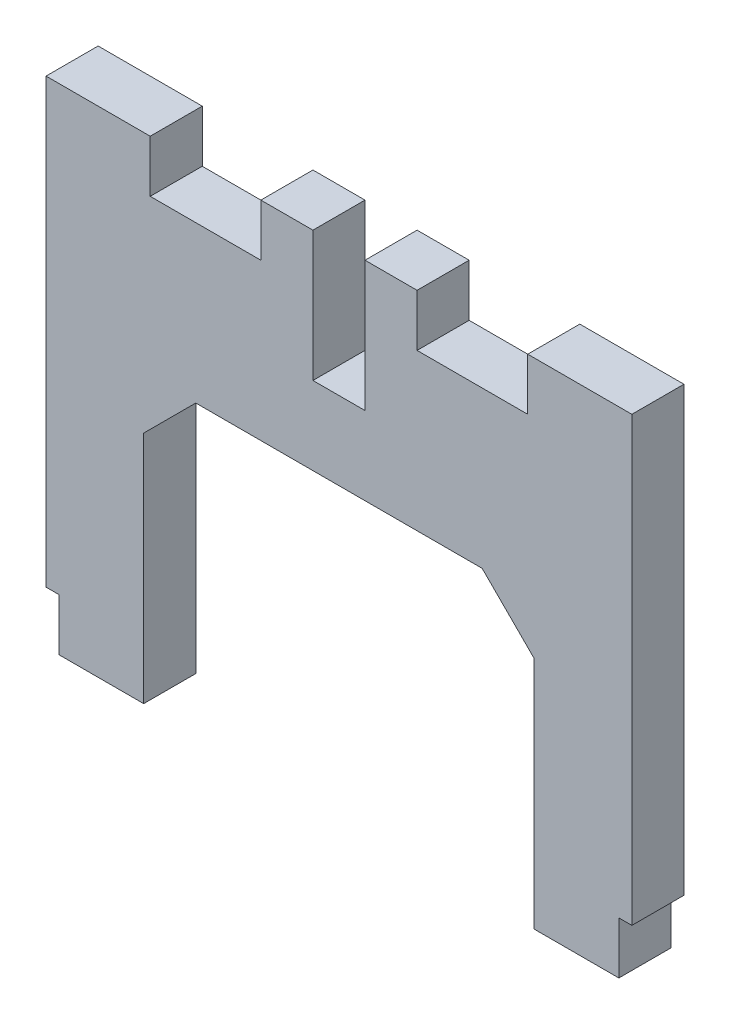
ISO-10303-21;
HEADER;
FILE_DESCRIPTION(('STEP AP214'),'2;1');
FILE_NAME('part.step','',(''),(''),'','','');
FILE_SCHEMA(('AUTOMOTIVE_DESIGN { 1 0 10303 214 1 1 1 1 }'));
ENDSEC;
DATA;
#1=APPLICATION_CONTEXT('core data for automotive mechanical design processes');
#2=APPLICATION_PROTOCOL_DEFINITION('international standard','automotive_design',2000,#1);
#3=PRODUCT_CONTEXT('',#1,'mechanical');
#4=PRODUCT('Part','Part','',(#3));
#5=PRODUCT_RELATED_PRODUCT_CATEGORY('part','',(#4));
#6=PRODUCT_DEFINITION_FORMATION('','',#4);
#7=PRODUCT_DEFINITION_CONTEXT('part definition',#1,'design');
#8=PRODUCT_DEFINITION('design','',#6,#7);
#9=PRODUCT_DEFINITION_SHAPE('','',#8);
#10=(LENGTH_UNIT() NAMED_UNIT(*) SI_UNIT(.MILLI.,.METRE.));
#11=(NAMED_UNIT(*) PLANE_ANGLE_UNIT() SI_UNIT($,.RADIAN.));
#12=(NAMED_UNIT(*) SI_UNIT($,.STERADIAN.) SOLID_ANGLE_UNIT());
#13=UNCERTAINTY_MEASURE_WITH_UNIT(LENGTH_MEASURE(1.E-05),#10,'distance_accuracy_value','');
#14=(GEOMETRIC_REPRESENTATION_CONTEXT(3) GLOBAL_UNCERTAINTY_ASSIGNED_CONTEXT((#13)) GLOBAL_UNIT_ASSIGNED_CONTEXT((#10,
#11,#12)) REPRESENTATION_CONTEXT('',''));
#15=CARTESIAN_POINT('',(0.,0.,0.));
#16=DIRECTION('',(0.,0.,1.));
#17=DIRECTION('',(1.,0.,0.));
#18=AXIS2_PLACEMENT_3D('',#15,#16,#17);
#19=CARTESIAN_POINT('',(-1.,0.,4.));
#20=DIRECTION('',(0.,1.,0.));
#21=DIRECTION('',(0.,0.,1.));
#22=AXIS2_PLACEMENT_3D('',#19,#20,#21);
#23=PLANE('',#22);
#24=DIRECTION('',(1.,0.,0.));
#25=VECTOR('',#24,1.);
#26=CARTESIAN_POINT('',(-1.,0.,0.));
#27=LINE('',#26,#25);
#28=CARTESIAN_POINT('',(-1.,0.,0.));
#29=VERTEX_POINT('',#28);
#30=CARTESIAN_POINT('',(0.,0.,0.));
#31=VERTEX_POINT('',#30);
#32=EDGE_CURVE('E280',#29,#31,#27,.T.);
#33=ORIENTED_EDGE('',*,*,#32,.T.);
#34=DIRECTION('',(0.,0.,-1.));
#35=VECTOR('',#34,1.);
#36=CARTESIAN_POINT('',(0.,0.,4.));
#37=LINE('',#36,#35);
#38=CARTESIAN_POINT('',(0.,0.,4.));
#39=VERTEX_POINT('',#38);
#40=EDGE_CURVE('E328',#39,#31,#37,.T.);
#41=ORIENTED_EDGE('',*,*,#40,.F.);
#42=DIRECTION('',(1.,0.,0.));
#43=VECTOR('',#42,1.);
#44=CARTESIAN_POINT('',(-1.,0.,4.));
#45=LINE('',#44,#43);
#46=CARTESIAN_POINT('',(-1.,0.,4.));
#47=VERTEX_POINT('',#46);
#48=EDGE_CURVE('E281',#47,#39,#45,.T.);
#49=ORIENTED_EDGE('',*,*,#48,.F.);
#50=DIRECTION('',(0.,0.,-1.));
#51=VECTOR('',#50,1.);
#52=CARTESIAN_POINT('',(-1.,0.,4.));
#53=LINE('',#52,#51);
#54=EDGE_CURVE('E299',#47,#29,#53,.T.);
#55=ORIENTED_EDGE('',*,*,#54,.T.);
#56=EDGE_LOOP('',(#33,#41,#49,#55));
#57=FACE_BOUND('',#56,.T.);
#58=ADVANCED_FACE('F41',(#57),#23,.F.);
#59=CARTESIAN_POINT('',(0.,0.,4.));
#60=DIRECTION('',(-1.,0.,0.));
#61=DIRECTION('',(0.,0.,1.));
#62=AXIS2_PLACEMENT_3D('',#59,#60,#61);
#63=PLANE('',#62);
#64=DIRECTION('',(0.,1.,0.));
#65=VECTOR('',#64,1.);
#66=CARTESIAN_POINT('',(0.,0.,0.));
#67=LINE('',#66,#65);
#68=CARTESIAN_POINT('',(0.,34.,0.));
#69=VERTEX_POINT('',#68);
#70=EDGE_CURVE('E302',#31,#69,#67,.T.);
#71=ORIENTED_EDGE('',*,*,#70,.T.);
#72=DIRECTION('',(0.,0.,1.));
#73=VECTOR('',#72,1.);
#74=CARTESIAN_POINT('',(0.,34.,-8.94427190999916));
#75=LINE('',#74,#73);
#76=CARTESIAN_POINT('',(0.,34.,4.));
#77=VERTEX_POINT('',#76);
#78=EDGE_CURVE('E392',#69,#77,#75,.T.);
#79=ORIENTED_EDGE('',*,*,#78,.T.);
#80=DIRECTION('',(0.,1.,0.));
#81=VECTOR('',#80,1.);
#82=CARTESIAN_POINT('',(0.,0.,4.));
#83=LINE('',#82,#81);
#84=EDGE_CURVE('E283',#39,#77,#83,.T.);
#85=ORIENTED_EDGE('',*,*,#84,.F.);
#86=ORIENTED_EDGE('',*,*,#40,.T.);
#87=EDGE_LOOP('',(#71,#79,#85,#86));
#88=FACE_BOUND('',#87,.T.);
#89=ADVANCED_FACE('F388',(#88),#63,.F.);
#90=CARTESIAN_POINT('',(0.,30.,4.));
#91=DIRECTION('',(0.,-1.,0.));
#92=DIRECTION('',(1.,0.,0.));
#93=AXIS2_PLACEMENT_3D('',#90,#91,#92);
#94=PLANE('',#93);
#95=DIRECTION('',(-1.,0.,0.));
#96=VECTOR('',#95,1.);
#97=CARTESIAN_POINT('',(0.,30.,4.));
#98=LINE('',#97,#96);
#99=CARTESIAN_POINT('',(-8.,30.,4.));
#100=VERTEX_POINT('',#99);
#101=CARTESIAN_POINT('',(-16.5,30.,4.));
#102=VERTEX_POINT('',#101);
#103=EDGE_CURVE('E57',#100,#102,#98,.T.);
#104=ORIENTED_EDGE('',*,*,#103,.F.);
#105=DIRECTION('',(0.,0.,1.));
#106=VECTOR('',#105,1.);
#107=CARTESIAN_POINT('',(-8.,30.,-8.94427190999916));
#108=LINE('',#107,#106);
#109=CARTESIAN_POINT('',(-8.,30.,0.));
#110=VERTEX_POINT('',#109);
#111=EDGE_CURVE('E407',#110,#100,#108,.T.);
#112=ORIENTED_EDGE('',*,*,#111,.F.);
#113=DIRECTION('',(-1.,0.,0.));
#114=VECTOR('',#113,1.);
#115=CARTESIAN_POINT('',(0.,30.,0.));
#116=LINE('',#115,#114);
#117=CARTESIAN_POINT('',(-16.5,30.,0.));
#118=VERTEX_POINT('',#117);
#119=EDGE_CURVE('E304',#110,#118,#116,.T.);
#120=ORIENTED_EDGE('',*,*,#119,.T.);
#121=DIRECTION('',(0.,0.,1.));
#122=VECTOR('',#121,1.);
#123=CARTESIAN_POINT('',(-16.5,30.,-8.94427190999916));
#124=LINE('',#123,#122);
#125=EDGE_CURVE('E426',#118,#102,#124,.T.);
#126=ORIENTED_EDGE('',*,*,#125,.T.);
#127=EDGE_LOOP('',(#104,#112,#120,#126));
#128=FACE_BOUND('',#127,.T.);
#129=ADVANCED_FACE('F507',(#128),#94,.F.);
#130=CARTESIAN_POINT('',(-20.5,30.,4.));
#131=DIRECTION('',(1.,0.,0.));
#132=DIRECTION('',(0.,1.,0.));
#133=AXIS2_PLACEMENT_3D('',#130,#131,#132);
#134=PLANE('',#133);
#135=DIRECTION('',(0.,-1.,0.));
#136=VECTOR('',#135,1.);
#137=CARTESIAN_POINT('',(-20.5,30.,0.));
#138=LINE('',#137,#136);
#139=CARTESIAN_POINT('',(-20.5,34.,0.));
#140=VERTEX_POINT('',#139);
#141=CARTESIAN_POINT('',(-20.5,24.,0.));
#142=VERTEX_POINT('',#141);
#143=EDGE_CURVE('E306',#140,#142,#138,.T.);
#144=ORIENTED_EDGE('',*,*,#143,.T.);
#145=DIRECTION('',(0.,0.,-1.));
#146=VECTOR('',#145,1.);
#147=CARTESIAN_POINT('',(-20.5,24.,4.));
#148=LINE('',#147,#146);
#149=CARTESIAN_POINT('',(-20.5,24.,4.));
#150=VERTEX_POINT('',#149);
#151=EDGE_CURVE('E325',#150,#142,#148,.T.);
#152=ORIENTED_EDGE('',*,*,#151,.F.);
#153=DIRECTION('',(0.,-1.,0.));
#154=VECTOR('',#153,1.);
#155=CARTESIAN_POINT('',(-20.5,30.,4.));
#156=LINE('',#155,#154);
#157=CARTESIAN_POINT('',(-20.5,34.,4.));
#158=VERTEX_POINT('',#157);
#159=EDGE_CURVE('E287',#158,#150,#156,.T.);
#160=ORIENTED_EDGE('',*,*,#159,.F.);
#161=DIRECTION('',(0.,0.,1.));
#162=VECTOR('',#161,1.);
#163=CARTESIAN_POINT('',(-20.5,34.,-8.94427190999916));
#164=LINE('',#163,#162);
#165=EDGE_CURVE('E419',#140,#158,#164,.T.);
#166=ORIENTED_EDGE('',*,*,#165,.F.);
#167=EDGE_LOOP('',(#144,#152,#160,#166));
#168=FACE_BOUND('',#167,.T.);
#169=ADVANCED_FACE('F493',(#168),#134,.F.);
#170=CARTESIAN_POINT('',(-20.5,24.,4.));
#171=DIRECTION('',(0.,-1.,0.));
#172=DIRECTION('',(1.,0.,0.));
#173=AXIS2_PLACEMENT_3D('',#170,#171,#172);
#174=PLANE('',#173);
#175=DIRECTION('',(-1.,0.,0.));
#176=VECTOR('',#175,1.);
#177=CARTESIAN_POINT('',(-20.5,24.,0.));
#178=LINE('',#177,#176);
#179=CARTESIAN_POINT('',(-24.5,24.,0.));
#180=VERTEX_POINT('',#179);
#181=EDGE_CURVE('E308',#142,#180,#178,.T.);
#182=ORIENTED_EDGE('',*,*,#181,.T.);
#183=DIRECTION('',(0.,0.,-1.));
#184=VECTOR('',#183,1.);
#185=CARTESIAN_POINT('',(-24.5,24.,4.));
#186=LINE('',#185,#184);
#187=CARTESIAN_POINT('',(-24.5,24.,4.));
#188=VERTEX_POINT('',#187);
#189=EDGE_CURVE('E270',#188,#180,#186,.T.);
#190=ORIENTED_EDGE('',*,*,#189,.F.);
#191=DIRECTION('',(-1.,0.,0.));
#192=VECTOR('',#191,1.);
#193=CARTESIAN_POINT('',(-20.5,24.,4.));
#194=LINE('',#193,#192);
#195=EDGE_CURVE('E289',#150,#188,#194,.T.);
#196=ORIENTED_EDGE('',*,*,#195,.F.);
#197=ORIENTED_EDGE('',*,*,#151,.T.);
#198=EDGE_LOOP('',(#182,#190,#196,#197));
#199=FACE_BOUND('',#198,.T.);
#200=ADVANCED_FACE('F490',(#199),#174,.F.);
#201=CARTESIAN_POINT('',(-22.5,18.,4.));
#202=DIRECTION('',(0.,1.,0.));
#203=DIRECTION('',(-1.,0.,0.));
#204=AXIS2_PLACEMENT_3D('',#201,#202,#203);
#205=PLANE('',#204);
#206=DIRECTION('',(1.,0.,0.));
#207=VECTOR('',#206,1.);
#208=CARTESIAN_POINT('',(-22.5,18.,4.));
#209=LINE('',#208,#207);
#210=CARTESIAN_POINT('',(-33.5,18.,4.));
#211=VERTEX_POINT('',#210);
#212=CARTESIAN_POINT('',(-11.5,18.,4.));
#213=VERTEX_POINT('',#212);
#214=EDGE_CURVE('E291',#211,#213,#209,.T.);
#215=ORIENTED_EDGE('',*,*,#214,.F.);
#216=DIRECTION('',(0.,0.,-1.));
#217=VECTOR('',#216,1.);
#218=CARTESIAN_POINT('',(-33.5,18.,4.));
#219=LINE('',#218,#217);
#220=CARTESIAN_POINT('',(-33.5,18.,0.));
#221=VERTEX_POINT('',#220);
#222=EDGE_CURVE('E342',#211,#221,#219,.T.);
#223=ORIENTED_EDGE('',*,*,#222,.T.);
#224=DIRECTION('',(1.,0.,0.));
#225=VECTOR('',#224,1.);
#226=CARTESIAN_POINT('',(-22.5,18.,0.));
#227=LINE('',#226,#225);
#228=CARTESIAN_POINT('',(-11.5,18.,0.));
#229=VERTEX_POINT('',#228);
#230=EDGE_CURVE('E310',#221,#229,#227,.T.);
#231=ORIENTED_EDGE('',*,*,#230,.T.);
#232=DIRECTION('',(0.,0.,1.));
#233=VECTOR('',#232,1.);
#234=CARTESIAN_POINT('',(-11.5,18.,4.));
#235=LINE('',#234,#233);
#236=EDGE_CURVE('E334',#229,#213,#235,.T.);
#237=ORIENTED_EDGE('',*,*,#236,.T.);
#238=EDGE_LOOP('',(#215,#223,#231,#237));
#239=FACE_BOUND('',#238,.T.);
#240=ADVANCED_FACE('F363',(#239),#205,.F.);
#241=CARTESIAN_POINT('',(-7.5,18.,4.));
#242=DIRECTION('',(1.,0.,0.));
#243=DIRECTION('',(0.,1.,0.));
#244=AXIS2_PLACEMENT_3D('',#241,#242,#243);
#245=PLANE('',#244);
#246=DIRECTION('',(0.,-1.,0.));
#247=VECTOR('',#246,1.);
#248=CARTESIAN_POINT('',(-7.5,18.,4.));
#249=LINE('',#248,#247);
#250=CARTESIAN_POINT('',(-7.5,14.,4.));
#251=VERTEX_POINT('',#250);
#252=CARTESIAN_POINT('',(-7.5,-4.,4.));
#253=VERTEX_POINT('',#252);
#254=EDGE_CURVE('E293',#251,#253,#249,.T.);
#255=ORIENTED_EDGE('',*,*,#254,.F.);
#256=DIRECTION('',(0.,0.,-1.));
#257=VECTOR('',#256,1.);
#258=CARTESIAN_POINT('',(-7.5,14.,0.));
#259=LINE('',#258,#257);
#260=CARTESIAN_POINT('',(-7.5,14.,0.));
#261=VERTEX_POINT('',#260);
#262=EDGE_CURVE('E331',#251,#261,#259,.T.);
#263=ORIENTED_EDGE('',*,*,#262,.T.);
#264=DIRECTION('',(0.,-1.,0.));
#265=VECTOR('',#264,1.);
#266=CARTESIAN_POINT('',(-7.5,18.,0.));
#267=LINE('',#266,#265);
#268=CARTESIAN_POINT('',(-7.5,-4.,0.));
#269=VERTEX_POINT('',#268);
#270=EDGE_CURVE('E312',#261,#269,#267,.T.);
#271=ORIENTED_EDGE('',*,*,#270,.T.);
#272=DIRECTION('',(0.,0.,-1.));
#273=VECTOR('',#272,1.);
#274=CARTESIAN_POINT('',(-7.5,-4.,4.));
#275=LINE('',#274,#273);
#276=EDGE_CURVE('E322',#253,#269,#275,.T.);
#277=ORIENTED_EDGE('',*,*,#276,.F.);
#278=EDGE_LOOP('',(#255,#263,#271,#277));
#279=FACE_BOUND('',#278,.T.);
#280=ADVANCED_FACE('F372',(#279),#245,.F.);
#281=CARTESIAN_POINT('',(-7.5,-4.,4.));
#282=DIRECTION('',(0.,1.,0.));
#283=DIRECTION('',(0.,0.,1.));
#284=AXIS2_PLACEMENT_3D('',#281,#282,#283);
#285=PLANE('',#284);
#286=DIRECTION('',(1.,0.,0.));
#287=VECTOR('',#286,1.);
#288=CARTESIAN_POINT('',(-7.5,-4.,0.));
#289=LINE('',#288,#287);
#290=CARTESIAN_POINT('',(-1.,-4.,0.));
#291=VERTEX_POINT('',#290);
#292=EDGE_CURVE('E314',#269,#291,#289,.T.);
#293=ORIENTED_EDGE('',*,*,#292,.T.);
#294=DIRECTION('',(0.,0.,-1.));
#295=VECTOR('',#294,1.);
#296=CARTESIAN_POINT('',(-1.,-4.,4.));
#297=LINE('',#296,#295);
#298=CARTESIAN_POINT('',(-1.,-4.,4.));
#299=VERTEX_POINT('',#298);
#300=EDGE_CURVE('E319',#299,#291,#297,.T.);
#301=ORIENTED_EDGE('',*,*,#300,.F.);
#302=DIRECTION('',(1.,0.,0.));
#303=VECTOR('',#302,1.);
#304=CARTESIAN_POINT('',(-7.5,-4.,4.));
#305=LINE('',#304,#303);
#306=EDGE_CURVE('E295',#253,#299,#305,.T.);
#307=ORIENTED_EDGE('',*,*,#306,.F.);
#308=ORIENTED_EDGE('',*,*,#276,.T.);
#309=EDGE_LOOP('',(#293,#301,#307,#308));
#310=FACE_BOUND('',#309,.T.);
#311=ADVANCED_FACE('F378',(#310),#285,.F.);
#312=CARTESIAN_POINT('',(-1.,-4.,4.));
#313=DIRECTION('',(-1.,0.,0.));
#314=DIRECTION('',(0.,0.,1.));
#315=AXIS2_PLACEMENT_3D('',#312,#313,#314);
#316=PLANE('',#315);
#317=DIRECTION('',(0.,1.,0.));
#318=VECTOR('',#317,1.);
#319=CARTESIAN_POINT('',(-1.,-4.,0.));
#320=LINE('',#319,#318);
#321=EDGE_CURVE('E284',#291,#29,#320,.T.);
#322=ORIENTED_EDGE('',*,*,#321,.T.);
#323=ORIENTED_EDGE('',*,*,#54,.F.);
#324=DIRECTION('',(0.,1.,0.));
#325=VECTOR('',#324,1.);
#326=CARTESIAN_POINT('',(-1.,-4.,4.));
#327=LINE('',#326,#325);
#328=EDGE_CURVE('E297',#299,#47,#327,.T.);
#329=ORIENTED_EDGE('',*,*,#328,.F.);
#330=ORIENTED_EDGE('',*,*,#300,.T.);
#331=EDGE_LOOP('',(#322,#323,#329,#330));
#332=FACE_BOUND('',#331,.T.);
#333=ADVANCED_FACE('F384',(#332),#316,.F.);
#334=CARTESIAN_POINT('',(0.,0.,4.));
#335=DIRECTION('',(0.,0.,1.));
#336=DIRECTION('',(1.,0.,0.));
#337=AXIS2_PLACEMENT_3D('',#334,#335,#336);
#338=PLANE('',#337);
#339=ORIENTED_EDGE('',*,*,#48,.T.);
#340=ORIENTED_EDGE('',*,*,#84,.T.);
#341=DIRECTION('',(-1.,0.,0.));
#342=VECTOR('',#341,1.);
#343=CARTESIAN_POINT('',(0.,34.,4.));
#344=LINE('',#343,#342);
#345=CARTESIAN_POINT('',(-8.,34.,4.));
#346=VERTEX_POINT('',#345);
#347=EDGE_CURVE('E395',#77,#346,#344,.T.);
#348=ORIENTED_EDGE('',*,*,#347,.T.);
#349=DIRECTION('',(0.,-1.,0.));
#350=VECTOR('',#349,1.);
#351=CARTESIAN_POINT('',(-8.,30.,4.));
#352=LINE('',#351,#350);
#353=EDGE_CURVE('E397',#346,#100,#352,.T.);
#354=ORIENTED_EDGE('',*,*,#353,.T.);
#355=ORIENTED_EDGE('',*,*,#103,.T.);
#356=DIRECTION('',(0.,1.,0.));
#357=VECTOR('',#356,1.);
#358=CARTESIAN_POINT('',(-16.5,30.,4.));
#359=LINE('',#358,#357);
#360=CARTESIAN_POINT('',(-16.5,34.,4.));
#361=VERTEX_POINT('',#360);
#362=EDGE_CURVE('E414',#102,#361,#359,.T.);
#363=ORIENTED_EDGE('',*,*,#362,.T.);
#364=DIRECTION('',(-1.,0.,0.));
#365=VECTOR('',#364,1.);
#366=CARTESIAN_POINT('',(-20.5,34.,4.));
#367=LINE('',#366,#365);
#368=EDGE_CURVE('E423',#361,#158,#367,.T.);
#369=ORIENTED_EDGE('',*,*,#368,.T.);
#370=ORIENTED_EDGE('',*,*,#159,.T.);
#371=ORIENTED_EDGE('',*,*,#195,.T.);
#372=DIRECTION('',(0.,-1.,0.));
#373=VECTOR('',#372,1.);
#374=CARTESIAN_POINT('',(-24.5,30.,4.));
#375=LINE('',#374,#373);
#376=CARTESIAN_POINT('',(-24.5,34.,4.));
#377=VERTEX_POINT('',#376);
#378=EDGE_CURVE('E241',#377,#188,#375,.T.);
#379=ORIENTED_EDGE('',*,*,#378,.F.);
#380=DIRECTION('',(-1.,0.,0.));
#381=VECTOR('',#380,1.);
#382=CARTESIAN_POINT('',(-24.5,34.,4.));
#383=LINE('',#382,#381);
#384=CARTESIAN_POINT('',(-28.5,34.,4.));
#385=VERTEX_POINT('',#384);
#386=EDGE_CURVE('E421',#377,#385,#383,.T.);
#387=ORIENTED_EDGE('',*,*,#386,.T.);
#388=DIRECTION('',(0.,-1.,0.));
#389=VECTOR('',#388,1.);
#390=CARTESIAN_POINT('',(-28.5,30.,4.));
#391=LINE('',#390,#389);
#392=CARTESIAN_POINT('',(-28.5,30.,4.));
#393=VERTEX_POINT('',#392);
#394=EDGE_CURVE('E239',#385,#393,#391,.T.);
#395=ORIENTED_EDGE('',*,*,#394,.T.);
#396=DIRECTION('',(1.,0.,0.));
#397=VECTOR('',#396,1.);
#398=CARTESIAN_POINT('',(-45.,30.,4.));
#399=LINE('',#398,#397);
#400=CARTESIAN_POINT('',(-37.,30.,4.));
#401=VERTEX_POINT('',#400);
#402=EDGE_CURVE('E230',#401,#393,#399,.T.);
#403=ORIENTED_EDGE('',*,*,#402,.F.);
#404=DIRECTION('',(0.,1.,0.));
#405=VECTOR('',#404,1.);
#406=CARTESIAN_POINT('',(-37.,30.,4.));
#407=LINE('',#406,#405);
#408=CARTESIAN_POINT('',(-37.,34.,4.));
#409=VERTEX_POINT('',#408);
#410=EDGE_CURVE('E214',#401,#409,#407,.T.);
#411=ORIENTED_EDGE('',*,*,#410,.T.);
#412=DIRECTION('',(-1.,0.,0.));
#413=VECTOR('',#412,1.);
#414=CARTESIAN_POINT('',(-45.,34.,4.));
#415=LINE('',#414,#413);
#416=CARTESIAN_POINT('',(-45.,34.,4.));
#417=VERTEX_POINT('',#416);
#418=EDGE_CURVE('E225',#409,#417,#415,.T.);
#419=ORIENTED_EDGE('',*,*,#418,.T.);
#420=DIRECTION('',(0.,1.,0.));
#421=VECTOR('',#420,1.);
#422=CARTESIAN_POINT('',(-45.,0.,4.));
#423=LINE('',#422,#421);
#424=CARTESIAN_POINT('',(-45.,0.,4.));
#425=VERTEX_POINT('',#424);
#426=EDGE_CURVE('E240',#425,#417,#423,.T.);
#427=ORIENTED_EDGE('',*,*,#426,.F.);
#428=DIRECTION('',(-1.,0.,0.));
#429=VECTOR('',#428,1.);
#430=CARTESIAN_POINT('',(-44.,0.,4.));
#431=LINE('',#430,#429);
#432=CARTESIAN_POINT('',(-44.,0.,4.));
#433=VERTEX_POINT('',#432);
#434=EDGE_CURVE('E268',#433,#425,#431,.T.);
#435=ORIENTED_EDGE('',*,*,#434,.F.);
#436=DIRECTION('',(0.,1.,0.));
#437=VECTOR('',#436,1.);
#438=CARTESIAN_POINT('',(-44.,-4.,4.));
#439=LINE('',#438,#437);
#440=CARTESIAN_POINT('',(-44.,-4.,4.));
#441=VERTEX_POINT('',#440);
#442=EDGE_CURVE('E447',#441,#433,#439,.T.);
#443=ORIENTED_EDGE('',*,*,#442,.F.);
#444=DIRECTION('',(-1.,0.,0.));
#445=VECTOR('',#444,1.);
#446=CARTESIAN_POINT('',(-37.5,-4.,4.));
#447=LINE('',#446,#445);
#448=CARTESIAN_POINT('',(-37.5,-4.,4.));
#449=VERTEX_POINT('',#448);
#450=EDGE_CURVE('E450',#449,#441,#447,.T.);
#451=ORIENTED_EDGE('',*,*,#450,.F.);
#452=DIRECTION('',(0.,-1.,0.));
#453=VECTOR('',#452,1.);
#454=CARTESIAN_POINT('',(-37.5,18.,4.));
#455=LINE('',#454,#453);
#456=CARTESIAN_POINT('',(-37.5,14.,4.));
#457=VERTEX_POINT('',#456);
#458=EDGE_CURVE('E246',#457,#449,#455,.T.);
#459=ORIENTED_EDGE('',*,*,#458,.F.);
#460=DIRECTION('',(0.707106781186543,0.707106781186552,0.));
#461=VECTOR('',#460,1.);
#462=CARTESIAN_POINT('',(-33.5,18.,4.));
#463=LINE('',#462,#461);
#464=EDGE_CURVE('E11',#457,#211,#463,.T.);
#465=ORIENTED_EDGE('',*,*,#464,.T.);
#466=ORIENTED_EDGE('',*,*,#214,.T.);
#467=DIRECTION('',(-0.707106781186544,0.707106781186551,0.));
#468=VECTOR('',#467,1.);
#469=CARTESIAN_POINT('',(-7.5,14.,4.));
#470=LINE('',#469,#468);
#471=EDGE_CURVE('E340',#213,#251,#470,.F.);
#472=ORIENTED_EDGE('',*,*,#471,.T.);
#473=ORIENTED_EDGE('',*,*,#254,.T.);
#474=ORIENTED_EDGE('',*,*,#306,.T.);
#475=ORIENTED_EDGE('',*,*,#328,.T.);
#476=EDGE_LOOP('',(#339,#340,#348,#354,#355,#363,#369,#370,#371,#379,#387,#395,#403,#411,#419,
#427,#435,#443,#451,#459,#465,#466,#472,#473,#474,#475));
#477=FACE_BOUND('',#476,.T.);
#478=ADVANCED_FACE('F236',(#477),#338,.T.);
#479=CARTESIAN_POINT('',(0.,0.,0.));
#480=DIRECTION('',(0.,0.,1.));
#481=DIRECTION('',(1.,0.,0.));
#482=AXIS2_PLACEMENT_3D('',#479,#480,#481);
#483=PLANE('',#482);
#484=ORIENTED_EDGE('',*,*,#32,.F.);
#485=ORIENTED_EDGE('',*,*,#321,.F.);
#486=ORIENTED_EDGE('',*,*,#292,.F.);
#487=ORIENTED_EDGE('',*,*,#270,.F.);
#488=DIRECTION('',(0.707106781186544,-0.707106781186551,0.));
#489=VECTOR('',#488,1.);
#490=CARTESIAN_POINT('',(3.24999999999995,3.24999999999992,0.));
#491=LINE('',#490,#489);
#492=EDGE_CURVE('E337',#261,#229,#491,.F.);
#493=ORIENTED_EDGE('',*,*,#492,.T.);
#494=ORIENTED_EDGE('',*,*,#230,.F.);
#495=DIRECTION('',(-0.707106781186543,-0.707106781186552,0.));
#496=VECTOR('',#495,1.);
#497=CARTESIAN_POINT('',(-25.7500000000002,25.7499999999999,0.));
#498=LINE('',#497,#496);
#499=CARTESIAN_POINT('',(-37.5,14.,0.));
#500=VERTEX_POINT('',#499);
#501=EDGE_CURVE('E50',#221,#500,#498,.T.);
#502=ORIENTED_EDGE('',*,*,#501,.T.);
#503=DIRECTION('',(0.,-1.,0.));
#504=VECTOR('',#503,1.);
#505=CARTESIAN_POINT('',(-37.5,18.,0.));
#506=LINE('',#505,#504);
#507=CARTESIAN_POINT('',(-37.5,-4.,0.));
#508=VERTEX_POINT('',#507);
#509=EDGE_CURVE('E260',#500,#508,#506,.T.);
#510=ORIENTED_EDGE('',*,*,#509,.T.);
#511=DIRECTION('',(-1.,0.,0.));
#512=VECTOR('',#511,1.);
#513=CARTESIAN_POINT('',(-37.5,-4.,0.));
#514=LINE('',#513,#512);
#515=CARTESIAN_POINT('',(-44.,-4.,0.));
#516=VERTEX_POINT('',#515);
#517=EDGE_CURVE('E257',#508,#516,#514,.T.);
#518=ORIENTED_EDGE('',*,*,#517,.T.);
#519=DIRECTION('',(0.,1.,0.));
#520=VECTOR('',#519,1.);
#521=CARTESIAN_POINT('',(-44.,-4.,0.));
#522=LINE('',#521,#520);
#523=CARTESIAN_POINT('',(-44.,0.,0.));
#524=VERTEX_POINT('',#523);
#525=EDGE_CURVE('E253',#516,#524,#522,.T.);
#526=ORIENTED_EDGE('',*,*,#525,.T.);
#527=DIRECTION('',(-1.,0.,0.));
#528=VECTOR('',#527,1.);
#529=CARTESIAN_POINT('',(-44.,0.,0.));
#530=LINE('',#529,#528);
#531=CARTESIAN_POINT('',(-45.,0.,0.));
#532=VERTEX_POINT('',#531);
#533=EDGE_CURVE('E250',#524,#532,#530,.T.);
#534=ORIENTED_EDGE('',*,*,#533,.T.);
#535=DIRECTION('',(0.,1.,0.));
#536=VECTOR('',#535,1.);
#537=CARTESIAN_POINT('',(-45.,0.,0.));
#538=LINE('',#537,#536);
#539=CARTESIAN_POINT('',(-45.,34.,0.));
#540=VERTEX_POINT('',#539);
#541=EDGE_CURVE('E266',#532,#540,#538,.T.);
#542=ORIENTED_EDGE('',*,*,#541,.T.);
#543=DIRECTION('',(1.,0.,0.));
#544=VECTOR('',#543,1.);
#545=CARTESIAN_POINT('',(-45.,34.,0.));
#546=LINE('',#545,#544);
#547=CARTESIAN_POINT('',(-37.,34.,0.));
#548=VERTEX_POINT('',#547);
#549=EDGE_CURVE('E399',#540,#548,#546,.T.);
#550=ORIENTED_EDGE('',*,*,#549,.T.);
#551=DIRECTION('',(0.,-1.,0.));
#552=VECTOR('',#551,1.);
#553=CARTESIAN_POINT('',(-37.,30.,0.));
#554=LINE('',#553,#552);
#555=CARTESIAN_POINT('',(-37.,30.,0.));
#556=VERTEX_POINT('',#555);
#557=EDGE_CURVE('E402',#548,#556,#554,.T.);
#558=ORIENTED_EDGE('',*,*,#557,.T.);
#559=DIRECTION('',(1.,0.,0.));
#560=VECTOR('',#559,1.);
#561=CARTESIAN_POINT('',(-45.,30.,0.));
#562=LINE('',#561,#560);
#563=CARTESIAN_POINT('',(-28.5,30.,0.));
#564=VERTEX_POINT('',#563);
#565=EDGE_CURVE('E232',#556,#564,#562,.T.);
#566=ORIENTED_EDGE('',*,*,#565,.T.);
#567=DIRECTION('',(0.,1.,0.));
#568=VECTOR('',#567,1.);
#569=CARTESIAN_POINT('',(-28.5,30.,0.));
#570=LINE('',#569,#568);
#571=CARTESIAN_POINT('',(-28.5,34.,0.));
#572=VERTEX_POINT('',#571);
#573=EDGE_CURVE('E432',#564,#572,#570,.T.);
#574=ORIENTED_EDGE('',*,*,#573,.T.);
#575=DIRECTION('',(1.,0.,0.));
#576=VECTOR('',#575,1.);
#577=CARTESIAN_POINT('',(-24.5,34.,0.));
#578=LINE('',#577,#576);
#579=CARTESIAN_POINT('',(-24.5,34.,0.));
#580=VERTEX_POINT('',#579);
#581=EDGE_CURVE('E254',#572,#580,#578,.T.);
#582=ORIENTED_EDGE('',*,*,#581,.T.);
#583=DIRECTION('',(0.,-1.,0.));
#584=VECTOR('',#583,1.);
#585=CARTESIAN_POINT('',(-24.5,30.,0.));
#586=LINE('',#585,#584);
#587=EDGE_CURVE('E262',#580,#180,#586,.T.);
#588=ORIENTED_EDGE('',*,*,#587,.T.);
#589=ORIENTED_EDGE('',*,*,#181,.F.);
#590=ORIENTED_EDGE('',*,*,#143,.F.);
#591=DIRECTION('',(1.,0.,0.));
#592=VECTOR('',#591,1.);
#593=CARTESIAN_POINT('',(-20.5,34.,0.));
#594=LINE('',#593,#592);
#595=CARTESIAN_POINT('',(-16.5,34.,0.));
#596=VERTEX_POINT('',#595);
#597=EDGE_CURVE('E418',#140,#596,#594,.T.);
#598=ORIENTED_EDGE('',*,*,#597,.T.);
#599=DIRECTION('',(0.,-1.,0.));
#600=VECTOR('',#599,1.);
#601=CARTESIAN_POINT('',(-16.5,30.,0.));
#602=LINE('',#601,#600);
#603=EDGE_CURVE('E415',#596,#118,#602,.T.);
#604=ORIENTED_EDGE('',*,*,#603,.T.);
#605=ORIENTED_EDGE('',*,*,#119,.F.);
#606=DIRECTION('',(0.,1.,0.));
#607=VECTOR('',#606,1.);
#608=CARTESIAN_POINT('',(-8.,30.,0.));
#609=LINE('',#608,#607);
#610=CARTESIAN_POINT('',(-8.,34.,0.));
#611=VERTEX_POINT('',#610);
#612=EDGE_CURVE('E405',#110,#611,#609,.T.);
#613=ORIENTED_EDGE('',*,*,#612,.T.);
#614=DIRECTION('',(1.,0.,0.));
#615=VECTOR('',#614,1.);
#616=CARTESIAN_POINT('',(0.,34.,0.));
#617=LINE('',#616,#615);
#618=EDGE_CURVE('E412',#611,#69,#617,.T.);
#619=ORIENTED_EDGE('',*,*,#618,.T.);
#620=ORIENTED_EDGE('',*,*,#70,.F.);
#621=EDGE_LOOP('',(#484,#485,#486,#487,#493,#494,#502,#510,#518,#526,#534,#542,#550,#558,#566,
#574,#582,#588,#589,#590,#598,#604,#605,#613,#619,#620));
#622=FACE_BOUND('',#621,.T.);
#623=ADVANCED_FACE('F350',(#622),#483,.F.);
#624=CARTESIAN_POINT('',(-7.5,14.,4.));
#625=DIRECTION('',(-0.707106781186551,-0.707106781186544,0.));
#626=DIRECTION('',(0.,0.,1.));
#627=AXIS2_PLACEMENT_3D('',#624,#625,#626);
#628=PLANE('',#627);
#629=ORIENTED_EDGE('',*,*,#471,.F.);
#630=ORIENTED_EDGE('',*,*,#236,.F.);
#631=ORIENTED_EDGE('',*,*,#492,.F.);
#632=ORIENTED_EDGE('',*,*,#262,.F.);
#633=EDGE_LOOP('',(#629,#630,#631,#632));
#634=FACE_BOUND('',#633,.T.);
#635=ADVANCED_FACE('F368',(#634),#628,.T.);
#636=CARTESIAN_POINT('',(-44.,0.,4.));
#637=DIRECTION('',(0.,-1.,0.));
#638=DIRECTION('',(0.,0.,-1.));
#639=AXIS2_PLACEMENT_3D('',#636,#637,#638);
#640=PLANE('',#639);
#641=ORIENTED_EDGE('',*,*,#533,.F.);
#642=DIRECTION('',(0.,0.,-1.));
#643=VECTOR('',#642,1.);
#644=CARTESIAN_POINT('',(-44.,0.,4.));
#645=LINE('',#644,#643);
#646=EDGE_CURVE('E278',#433,#524,#645,.T.);
#647=ORIENTED_EDGE('',*,*,#646,.F.);
#648=ORIENTED_EDGE('',*,*,#434,.T.);
#649=DIRECTION('',(0.,0.,-1.));
#650=VECTOR('',#649,1.);
#651=CARTESIAN_POINT('',(-45.,0.,4.));
#652=LINE('',#651,#650);
#653=EDGE_CURVE('E243',#425,#532,#652,.T.);
#654=ORIENTED_EDGE('',*,*,#653,.T.);
#655=EDGE_LOOP('',(#641,#647,#648,#654));
#656=FACE_BOUND('',#655,.T.);
#657=ADVANCED_FACE('F532',(#656),#640,.T.);
#658=CARTESIAN_POINT('',(-44.,-4.,4.));
#659=DIRECTION('',(-1.,0.,0.));
#660=DIRECTION('',(0.,0.,1.));
#661=AXIS2_PLACEMENT_3D('',#658,#659,#660);
#662=PLANE('',#661);
#663=ORIENTED_EDGE('',*,*,#525,.F.);
#664=DIRECTION('',(0.,0.,-1.));
#665=VECTOR('',#664,1.);
#666=CARTESIAN_POINT('',(-44.,-4.,4.));
#667=LINE('',#666,#665);
#668=EDGE_CURVE('E276',#441,#516,#667,.T.);
#669=ORIENTED_EDGE('',*,*,#668,.F.);
#670=ORIENTED_EDGE('',*,*,#442,.T.);
#671=ORIENTED_EDGE('',*,*,#646,.T.);
#672=EDGE_LOOP('',(#663,#669,#670,#671));
#673=FACE_BOUND('',#672,.T.);
#674=ADVANCED_FACE('F459',(#673),#662,.T.);
#675=CARTESIAN_POINT('',(-37.5,-4.,4.));
#676=DIRECTION('',(0.,-1.,0.));
#677=DIRECTION('',(0.,0.,-1.));
#678=AXIS2_PLACEMENT_3D('',#675,#676,#677);
#679=PLANE('',#678);
#680=ORIENTED_EDGE('',*,*,#517,.F.);
#681=DIRECTION('',(0.,0.,-1.));
#682=VECTOR('',#681,1.);
#683=CARTESIAN_POINT('',(-37.5,-4.,4.));
#684=LINE('',#683,#682);
#685=EDGE_CURVE('E273',#449,#508,#684,.T.);
#686=ORIENTED_EDGE('',*,*,#685,.F.);
#687=ORIENTED_EDGE('',*,*,#450,.T.);
#688=ORIENTED_EDGE('',*,*,#668,.T.);
#689=EDGE_LOOP('',(#680,#686,#687,#688));
#690=FACE_BOUND('',#689,.T.);
#691=ADVANCED_FACE('F453',(#690),#679,.T.);
#692=CARTESIAN_POINT('',(-37.5,18.,4.));
#693=DIRECTION('',(1.,0.,0.));
#694=DIRECTION('',(0.,1.,0.));
#695=AXIS2_PLACEMENT_3D('',#692,#693,#694);
#696=PLANE('',#695);
#697=ORIENTED_EDGE('',*,*,#509,.F.);
#698=DIRECTION('',(0.,0.,1.));
#699=VECTOR('',#698,1.);
#700=CARTESIAN_POINT('',(-37.5,14.,4.));
#701=LINE('',#700,#699);
#702=EDGE_CURVE('E345',#500,#457,#701,.T.);
#703=ORIENTED_EDGE('',*,*,#702,.T.);
#704=ORIENTED_EDGE('',*,*,#458,.T.);
#705=ORIENTED_EDGE('',*,*,#685,.T.);
#706=EDGE_LOOP('',(#697,#703,#704,#705));
#707=FACE_BOUND('',#706,.T.);
#708=ADVANCED_FACE('F355',(#707),#696,.T.);
#709=CARTESIAN_POINT('',(-24.5,30.,4.));
#710=DIRECTION('',(1.,0.,0.));
#711=DIRECTION('',(0.,1.,0.));
#712=AXIS2_PLACEMENT_3D('',#709,#710,#711);
#713=PLANE('',#712);
#714=ORIENTED_EDGE('',*,*,#587,.F.);
#715=DIRECTION('',(0.,0.,1.));
#716=VECTOR('',#715,1.);
#717=CARTESIAN_POINT('',(-24.5,34.,-8.94427190999916));
#718=LINE('',#717,#716);
#719=EDGE_CURVE('E437',#580,#377,#718,.T.);
#720=ORIENTED_EDGE('',*,*,#719,.T.);
#721=ORIENTED_EDGE('',*,*,#378,.T.);
#722=ORIENTED_EDGE('',*,*,#189,.T.);
#723=EDGE_LOOP('',(#714,#720,#721,#722));
#724=FACE_BOUND('',#723,.T.);
#725=ADVANCED_FACE('F486',(#724),#713,.T.);
#726=CARTESIAN_POINT('',(-45.,30.,4.));
#727=DIRECTION('',(0.,1.,0.));
#728=DIRECTION('',(-1.,0.,0.));
#729=AXIS2_PLACEMENT_3D('',#726,#727,#728);
#730=PLANE('',#729);
#731=DIRECTION('',(0.,0.,1.));
#732=VECTOR('',#731,1.);
#733=CARTESIAN_POINT('',(-37.,30.,-8.94427190999916));
#734=LINE('',#733,#732);
#735=EDGE_CURVE('E218',#556,#401,#734,.T.);
#736=ORIENTED_EDGE('',*,*,#735,.T.);
#737=ORIENTED_EDGE('',*,*,#402,.T.);
#738=DIRECTION('',(0.,0.,1.));
#739=VECTOR('',#738,1.);
#740=CARTESIAN_POINT('',(-28.5,30.,-8.94427190999916));
#741=LINE('',#740,#739);
#742=EDGE_CURVE('E434',#564,#393,#741,.T.);
#743=ORIENTED_EDGE('',*,*,#742,.F.);
#744=ORIENTED_EDGE('',*,*,#565,.F.);
#745=EDGE_LOOP('',(#736,#737,#743,#744));
#746=FACE_BOUND('',#745,.T.);
#747=ADVANCED_FACE('F228',(#746),#730,.T.);
#748=CARTESIAN_POINT('',(-45.,0.,4.));
#749=DIRECTION('',(-1.,0.,0.));
#750=DIRECTION('',(0.,0.,1.));
#751=AXIS2_PLACEMENT_3D('',#748,#749,#750);
#752=PLANE('',#751);
#753=ORIENTED_EDGE('',*,*,#541,.F.);
#754=ORIENTED_EDGE('',*,*,#653,.F.);
#755=ORIENTED_EDGE('',*,*,#426,.T.);
#756=DIRECTION('',(0.,0.,1.));
#757=VECTOR('',#756,1.);
#758=CARTESIAN_POINT('',(-45.,34.,-8.94427190999916));
#759=LINE('',#758,#757);
#760=EDGE_CURVE('E468',#540,#417,#759,.T.);
#761=ORIENTED_EDGE('',*,*,#760,.F.);
#762=EDGE_LOOP('',(#753,#754,#755,#761));
#763=FACE_BOUND('',#762,.T.);
#764=ADVANCED_FACE('F466',(#763),#752,.T.);
#765=CARTESIAN_POINT('',(-33.5,18.,4.));
#766=DIRECTION('',(-0.707106781186552,0.707106781186543,0.));
#767=DIRECTION('',(0.,0.,-1.));
#768=AXIS2_PLACEMENT_3D('',#765,#766,#767);
#769=PLANE('',#768);
#770=ORIENTED_EDGE('',*,*,#464,.F.);
#771=ORIENTED_EDGE('',*,*,#702,.F.);
#772=ORIENTED_EDGE('',*,*,#501,.F.);
#773=ORIENTED_EDGE('',*,*,#222,.F.);
#774=EDGE_LOOP('',(#770,#771,#772,#773));
#775=FACE_BOUND('',#774,.T.);
#776=ADVANCED_FACE('F44',(#775),#769,.F.);
#777=CARTESIAN_POINT('',(-28.5,30.,-8.94427190999916));
#778=DIRECTION('',(-1.,0.,0.));
#779=DIRECTION('',(0.,0.,1.));
#780=AXIS2_PLACEMENT_3D('',#777,#778,#779);
#781=PLANE('',#780);
#782=ORIENTED_EDGE('',*,*,#573,.F.);
#783=ORIENTED_EDGE('',*,*,#742,.T.);
#784=ORIENTED_EDGE('',*,*,#394,.F.);
#785=DIRECTION('',(0.,0.,1.));
#786=VECTOR('',#785,1.);
#787=CARTESIAN_POINT('',(-28.5,34.,-8.94427190999916));
#788=LINE('',#787,#786);
#789=EDGE_CURVE('E439',#572,#385,#788,.T.);
#790=ORIENTED_EDGE('',*,*,#789,.F.);
#791=EDGE_LOOP('',(#782,#783,#784,#790));
#792=FACE_BOUND('',#791,.T.);
#793=ADVANCED_FACE('F478',(#792),#781,.T.);
#794=CARTESIAN_POINT('',(-24.5,34.,-8.94427190999916));
#795=DIRECTION('',(0.,1.,0.));
#796=DIRECTION('',(-1.,0.,0.));
#797=AXIS2_PLACEMENT_3D('',#794,#795,#796);
#798=PLANE('',#797);
#799=ORIENTED_EDGE('',*,*,#581,.F.);
#800=ORIENTED_EDGE('',*,*,#789,.T.);
#801=ORIENTED_EDGE('',*,*,#386,.F.);
#802=ORIENTED_EDGE('',*,*,#719,.F.);
#803=EDGE_LOOP('',(#799,#800,#801,#802));
#804=FACE_BOUND('',#803,.T.);
#805=ADVANCED_FACE('F483',(#804),#798,.T.);
#806=CARTESIAN_POINT('',(-20.5,34.,-8.94427190999916));
#807=DIRECTION('',(0.,1.,0.));
#808=DIRECTION('',(0.,0.,1.));
#809=AXIS2_PLACEMENT_3D('',#806,#807,#808);
#810=PLANE('',#809);
#811=ORIENTED_EDGE('',*,*,#597,.F.);
#812=ORIENTED_EDGE('',*,*,#165,.T.);
#813=ORIENTED_EDGE('',*,*,#368,.F.);
#814=DIRECTION('',(0.,0.,1.));
#815=VECTOR('',#814,1.);
#816=CARTESIAN_POINT('',(-16.5,34.,-8.94427190999916));
#817=LINE('',#816,#815);
#818=EDGE_CURVE('E429',#596,#361,#817,.T.);
#819=ORIENTED_EDGE('',*,*,#818,.F.);
#820=EDGE_LOOP('',(#811,#812,#813,#819));
#821=FACE_BOUND('',#820,.T.);
#822=ADVANCED_FACE('F499',(#821),#810,.T.);
#823=CARTESIAN_POINT('',(-16.5,30.,-8.94427190999916));
#824=DIRECTION('',(1.,0.,0.));
#825=DIRECTION('',(0.,0.,-1.));
#826=AXIS2_PLACEMENT_3D('',#823,#824,#825);
#827=PLANE('',#826);
#828=ORIENTED_EDGE('',*,*,#603,.F.);
#829=ORIENTED_EDGE('',*,*,#818,.T.);
#830=ORIENTED_EDGE('',*,*,#362,.F.);
#831=ORIENTED_EDGE('',*,*,#125,.F.);
#832=EDGE_LOOP('',(#828,#829,#830,#831));
#833=FACE_BOUND('',#832,.T.);
#834=ADVANCED_FACE('F503',(#833),#827,.T.);
#835=CARTESIAN_POINT('',(-8.,30.,-8.94427190999916));
#836=DIRECTION('',(-1.,0.,0.));
#837=DIRECTION('',(0.,0.,1.));
#838=AXIS2_PLACEMENT_3D('',#835,#836,#837);
#839=PLANE('',#838);
#840=ORIENTED_EDGE('',*,*,#612,.F.);
#841=ORIENTED_EDGE('',*,*,#111,.T.);
#842=ORIENTED_EDGE('',*,*,#353,.F.);
#843=DIRECTION('',(0.,0.,1.));
#844=VECTOR('',#843,1.);
#845=CARTESIAN_POINT('',(-8.,34.,-8.94427190999916));
#846=LINE('',#845,#844);
#847=EDGE_CURVE('E409',#611,#346,#846,.T.);
#848=ORIENTED_EDGE('',*,*,#847,.F.);
#849=EDGE_LOOP('',(#840,#841,#842,#848));
#850=FACE_BOUND('',#849,.T.);
#851=ADVANCED_FACE('F509',(#850),#839,.T.);
#852=CARTESIAN_POINT('',(0.,34.,-8.94427190999916));
#853=DIRECTION('',(0.,1.,0.));
#854=DIRECTION('',(0.,0.,1.));
#855=AXIS2_PLACEMENT_3D('',#852,#853,#854);
#856=PLANE('',#855);
#857=ORIENTED_EDGE('',*,*,#618,.F.);
#858=ORIENTED_EDGE('',*,*,#847,.T.);
#859=ORIENTED_EDGE('',*,*,#347,.F.);
#860=ORIENTED_EDGE('',*,*,#78,.F.);
#861=EDGE_LOOP('',(#857,#858,#859,#860));
#862=FACE_BOUND('',#861,.T.);
#863=ADVANCED_FACE('F511',(#862),#856,.T.);
#864=CARTESIAN_POINT('',(-45.,34.,-8.94427190999916));
#865=DIRECTION('',(0.,1.,0.));
#866=DIRECTION('',(0.,0.,1.));
#867=AXIS2_PLACEMENT_3D('',#864,#865,#866);
#868=PLANE('',#867);
#869=ORIENTED_EDGE('',*,*,#549,.F.);
#870=ORIENTED_EDGE('',*,*,#760,.T.);
#871=ORIENTED_EDGE('',*,*,#418,.F.);
#872=DIRECTION('',(0.,0.,1.));
#873=VECTOR('',#872,1.);
#874=CARTESIAN_POINT('',(-37.,34.,-8.94427190999916));
#875=LINE('',#874,#873);
#876=EDGE_CURVE('E221',#548,#409,#875,.T.);
#877=ORIENTED_EDGE('',*,*,#876,.F.);
#878=EDGE_LOOP('',(#869,#870,#871,#877));
#879=FACE_BOUND('',#878,.T.);
#880=ADVANCED_FACE('F474',(#879),#868,.T.);
#881=CARTESIAN_POINT('',(-37.,30.,-8.94427190999916));
#882=DIRECTION('',(1.,0.,0.));
#883=DIRECTION('',(0.,0.,-1.));
#884=AXIS2_PLACEMENT_3D('',#881,#882,#883);
#885=PLANE('',#884);
#886=ORIENTED_EDGE('',*,*,#557,.F.);
#887=ORIENTED_EDGE('',*,*,#876,.T.);
#888=ORIENTED_EDGE('',*,*,#410,.F.);
#889=ORIENTED_EDGE('',*,*,#735,.F.);
#890=EDGE_LOOP('',(#886,#887,#888,#889));
#891=FACE_BOUND('',#890,.T.);
#892=ADVANCED_FACE('F217',(#891),#885,.T.);
#893=CLOSED_SHELL('',(#58,#89,#129,#169,#200,#240,#280,#311,#333,#478,#623,#635,#657,#674,#691,
#708,#725,#747,#764,#776,#793,#805,#822,#834,#851,#863,#880,#892));
#894=MANIFOLD_SOLID_BREP('B2',#893);
#895=ADVANCED_BREP_SHAPE_REPRESENTATION('',(#18,#894),#14);
#896=SHAPE_DEFINITION_REPRESENTATION(#9,#895);
ENDSEC;
END-ISO-10303-21;
